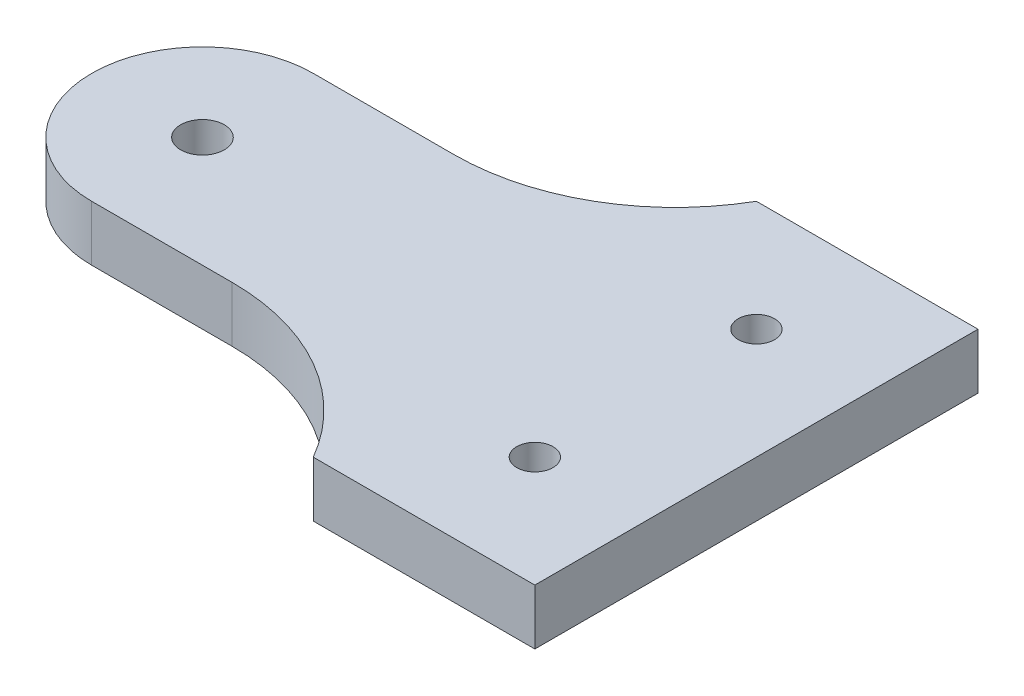
ISO-10303-21;
HEADER;
FILE_DESCRIPTION(('STEP AP214'),'2;1');
FILE_NAME('part.step','',(''),(''),'','','');
FILE_SCHEMA(('AUTOMOTIVE_DESIGN { 1 0 10303 214 1 1 1 1 }'));
ENDSEC;
DATA;
#1=APPLICATION_CONTEXT('core data for automotive mechanical design processes');
#2=APPLICATION_PROTOCOL_DEFINITION('international standard','automotive_design',2000,#1);
#3=PRODUCT_CONTEXT('',#1,'mechanical');
#4=PRODUCT('Part','Part','',(#3));
#5=PRODUCT_RELATED_PRODUCT_CATEGORY('part','',(#4));
#6=PRODUCT_DEFINITION_FORMATION('','',#4);
#7=PRODUCT_DEFINITION_CONTEXT('part definition',#1,'design');
#8=PRODUCT_DEFINITION('design','',#6,#7);
#9=PRODUCT_DEFINITION_SHAPE('','',#8);
#10=(LENGTH_UNIT() NAMED_UNIT(*) SI_UNIT(.MILLI.,.METRE.));
#11=(NAMED_UNIT(*) PLANE_ANGLE_UNIT() SI_UNIT($,.RADIAN.));
#12=(NAMED_UNIT(*) SI_UNIT($,.STERADIAN.) SOLID_ANGLE_UNIT());
#13=UNCERTAINTY_MEASURE_WITH_UNIT(LENGTH_MEASURE(1.E-05),#10,'distance_accuracy_value','');
#14=(GEOMETRIC_REPRESENTATION_CONTEXT(3) GLOBAL_UNCERTAINTY_ASSIGNED_CONTEXT((#13)) GLOBAL_UNIT_ASSIGNED_CONTEXT((#10,
#11,#12)) REPRESENTATION_CONTEXT('',''));
#15=CARTESIAN_POINT('',(0.,0.,0.));
#16=DIRECTION('',(0.,0.,1.));
#17=DIRECTION('',(1.,0.,0.));
#18=AXIS2_PLACEMENT_3D('',#15,#16,#17);
#19=CARTESIAN_POINT('',(0.,6.35,0.));
#20=DIRECTION('',(0.,-1.,0.));
#21=DIRECTION('',(0.,0.,-1.));
#22=AXIS2_PLACEMENT_3D('',#19,#20,#21);
#23=CYLINDRICAL_SURFACE('',#22,12.7);
#24=CARTESIAN_POINT('',(0.,0.,0.));
#25=DIRECTION('',(0.,1.,0.));
#26=DIRECTION('',(0.,0.,1.));
#27=AXIS2_PLACEMENT_3D('',#24,#25,#26);
#28=CIRCLE('',#27,12.7);
#29=CARTESIAN_POINT('',(0.,0.,-12.7));
#30=VERTEX_POINT('',#29);
#31=CARTESIAN_POINT('',(0.,0.,12.7));
#32=VERTEX_POINT('',#31);
#33=EDGE_CURVE('E122',#30,#32,#28,.T.);
#34=ORIENTED_EDGE('',*,*,#33,.T.);
#35=DIRECTION('',(0.,-1.,0.));
#36=VECTOR('',#35,1.);
#37=CARTESIAN_POINT('',(0.,6.35,12.7));
#38=LINE('',#37,#36);
#39=CARTESIAN_POINT('',(0.,6.35,12.7));
#40=VERTEX_POINT('',#39);
#41=EDGE_CURVE('E105',#40,#32,#38,.T.);
#42=ORIENTED_EDGE('',*,*,#41,.F.);
#43=CARTESIAN_POINT('',(0.,6.35,0.));
#44=DIRECTION('',(0.,1.,0.));
#45=DIRECTION('',(0.,0.,1.));
#46=AXIS2_PLACEMENT_3D('',#43,#44,#45);
#47=CIRCLE('',#46,12.7);
#48=CARTESIAN_POINT('',(0.,6.35,-12.7));
#49=VERTEX_POINT('',#48);
#50=EDGE_CURVE('E111',#49,#40,#47,.T.);
#51=ORIENTED_EDGE('',*,*,#50,.F.);
#52=DIRECTION('',(0.,-1.,0.));
#53=VECTOR('',#52,1.);
#54=CARTESIAN_POINT('',(0.,6.35,-12.7));
#55=LINE('',#54,#53);
#56=EDGE_CURVE('E153',#49,#30,#55,.T.);
#57=ORIENTED_EDGE('',*,*,#56,.T.);
#58=EDGE_LOOP('',(#34,#42,#51,#57));
#59=FACE_BOUND('',#58,.T.);
#60=ADVANCED_FACE('F37',(#59),#23,.T.);
#61=CARTESIAN_POINT('',(0.,6.35,12.7));
#62=DIRECTION('',(0.,0.,-1.));
#63=DIRECTION('',(-1.,0.,0.));
#64=AXIS2_PLACEMENT_3D('',#61,#62,#63);
#65=PLANE('',#64);
#66=DIRECTION('',(1.,0.,0.));
#67=VECTOR('',#66,1.);
#68=CARTESIAN_POINT('',(0.,0.,12.7));
#69=LINE('',#68,#67);
#70=CARTESIAN_POINT('',(16.1029547438753,0.,12.7));
#71=VERTEX_POINT('',#70);
#72=EDGE_CURVE('E169',#32,#71,#69,.T.);
#73=ORIENTED_EDGE('',*,*,#72,.T.);
#74=DIRECTION('',(0.,1.,0.));
#75=VECTOR('',#74,1.);
#76=CARTESIAN_POINT('',(16.1029547438753,6.35,12.7));
#77=LINE('',#76,#75);
#78=CARTESIAN_POINT('',(16.1029547438753,6.35,12.7));
#79=VERTEX_POINT('',#78);
#80=EDGE_CURVE('E108',#71,#79,#77,.T.);
#81=ORIENTED_EDGE('',*,*,#80,.T.);
#82=DIRECTION('',(1.,0.,0.));
#83=VECTOR('',#82,1.);
#84=CARTESIAN_POINT('',(0.,6.35,12.7));
#85=LINE('',#84,#83);
#86=EDGE_CURVE('E100',#40,#79,#85,.T.);
#87=ORIENTED_EDGE('',*,*,#86,.F.);
#88=ORIENTED_EDGE('',*,*,#41,.T.);
#89=EDGE_LOOP('',(#73,#81,#87,#88));
#90=FACE_BOUND('',#89,.T.);
#91=ADVANCED_FACE('F103',(#90),#65,.F.);
#92=CARTESIAN_POINT('',(63.5,6.35,25.4));
#93=DIRECTION('',(0.,0.,-1.));
#94=DIRECTION('',(-1.,0.,0.));
#95=AXIS2_PLACEMENT_3D('',#92,#93,#94);
#96=PLANE('',#95);
#97=DIRECTION('',(1.,0.,0.));
#98=VECTOR('',#97,1.);
#99=CARTESIAN_POINT('',(63.5,0.,25.4));
#100=LINE('',#99,#98);
#101=CARTESIAN_POINT('',(38.1,0.,25.4));
#102=VERTEX_POINT('',#101);
#103=CARTESIAN_POINT('',(63.5,0.,25.4));
#104=VERTEX_POINT('',#103);
#105=EDGE_CURVE('E167',#102,#104,#100,.T.);
#106=ORIENTED_EDGE('',*,*,#105,.T.);
#107=DIRECTION('',(0.,-1.,0.));
#108=VECTOR('',#107,1.);
#109=CARTESIAN_POINT('',(63.5,6.35,25.4));
#110=LINE('',#109,#108);
#111=CARTESIAN_POINT('',(63.5,6.35,25.4));
#112=VERTEX_POINT('',#111);
#113=EDGE_CURVE('E128',#112,#104,#110,.T.);
#114=ORIENTED_EDGE('',*,*,#113,.F.);
#115=DIRECTION('',(1.,0.,0.));
#116=VECTOR('',#115,1.);
#117=CARTESIAN_POINT('',(63.5,6.35,25.4));
#118=LINE('',#117,#116);
#119=CARTESIAN_POINT('',(38.1,6.35,25.4));
#120=VERTEX_POINT('',#119);
#121=EDGE_CURVE('E110',#120,#112,#118,.T.);
#122=ORIENTED_EDGE('',*,*,#121,.F.);
#123=DIRECTION('',(0.,-1.,0.));
#124=VECTOR('',#123,1.);
#125=CARTESIAN_POINT('',(38.1,6.35,25.4));
#126=LINE('',#125,#124);
#127=EDGE_CURVE('E123',#120,#102,#126,.T.);
#128=ORIENTED_EDGE('',*,*,#127,.T.);
#129=EDGE_LOOP('',(#106,#114,#122,#128));
#130=FACE_BOUND('',#129,.T.);
#131=ADVANCED_FACE('F226',(#130),#96,.F.);
#132=CARTESIAN_POINT('',(63.5,6.35,-25.4));
#133=DIRECTION('',(-1.,0.,0.));
#134=DIRECTION('',(0.,0.,1.));
#135=AXIS2_PLACEMENT_3D('',#132,#133,#134);
#136=PLANE('',#135);
#137=DIRECTION('',(0.,0.,-1.));
#138=VECTOR('',#137,1.);
#139=CARTESIAN_POINT('',(63.5,0.,-25.4));
#140=LINE('',#139,#138);
#141=CARTESIAN_POINT('',(63.5,0.,-25.4));
#142=VERTEX_POINT('',#141);
#143=EDGE_CURVE('E151',#104,#142,#140,.T.);
#144=ORIENTED_EDGE('',*,*,#143,.T.);
#145=DIRECTION('',(0.,-1.,0.));
#146=VECTOR('',#145,1.);
#147=CARTESIAN_POINT('',(63.5,6.35,-25.4));
#148=LINE('',#147,#146);
#149=CARTESIAN_POINT('',(63.5,6.35,-25.4));
#150=VERTEX_POINT('',#149);
#151=EDGE_CURVE('E150',#150,#142,#148,.T.);
#152=ORIENTED_EDGE('',*,*,#151,.F.);
#153=DIRECTION('',(0.,0.,-1.));
#154=VECTOR('',#153,1.);
#155=CARTESIAN_POINT('',(63.5,6.35,-25.4));
#156=LINE('',#155,#154);
#157=EDGE_CURVE('E163',#112,#150,#156,.T.);
#158=ORIENTED_EDGE('',*,*,#157,.F.);
#159=ORIENTED_EDGE('',*,*,#113,.T.);
#160=EDGE_LOOP('',(#144,#152,#158,#159));
#161=FACE_BOUND('',#160,.T.);
#162=ADVANCED_FACE('F162',(#161),#136,.F.);
#163=CARTESIAN_POINT('',(38.1,6.35,-25.4));
#164=DIRECTION('',(0.,0.,1.));
#165=DIRECTION('',(1.,0.,0.));
#166=AXIS2_PLACEMENT_3D('',#163,#164,#165);
#167=PLANE('',#166);
#168=DIRECTION('',(-1.,0.,0.));
#169=VECTOR('',#168,1.);
#170=CARTESIAN_POINT('',(38.1,0.,-25.4));
#171=LINE('',#170,#169);
#172=CARTESIAN_POINT('',(38.1,0.,-25.4));
#173=VERTEX_POINT('',#172);
#174=EDGE_CURVE('E142',#142,#173,#171,.T.);
#175=ORIENTED_EDGE('',*,*,#174,.T.);
#176=DIRECTION('',(0.,-1.,0.));
#177=VECTOR('',#176,1.);
#178=CARTESIAN_POINT('',(38.1,6.35,-25.4));
#179=LINE('',#178,#177);
#180=CARTESIAN_POINT('',(38.1,6.35,-25.4));
#181=VERTEX_POINT('',#180);
#182=EDGE_CURVE('E148',#181,#173,#179,.T.);
#183=ORIENTED_EDGE('',*,*,#182,.F.);
#184=DIRECTION('',(-1.,0.,0.));
#185=VECTOR('',#184,1.);
#186=CARTESIAN_POINT('',(38.1,6.35,-25.4));
#187=LINE('',#186,#185);
#188=EDGE_CURVE('E181',#150,#181,#187,.T.);
#189=ORIENTED_EDGE('',*,*,#188,.F.);
#190=ORIENTED_EDGE('',*,*,#151,.T.);
#191=EDGE_LOOP('',(#175,#183,#189,#190));
#192=FACE_BOUND('',#191,.T.);
#193=ADVANCED_FACE('F146',(#192),#167,.F.);
#194=CARTESIAN_POINT('',(0.,6.35,-12.7));
#195=DIRECTION('',(0.,0.,1.));
#196=DIRECTION('',(1.,0.,0.));
#197=AXIS2_PLACEMENT_3D('',#194,#195,#196);
#198=PLANE('',#197);
#199=DIRECTION('',(-1.,0.,0.));
#200=VECTOR('',#199,1.);
#201=CARTESIAN_POINT('',(0.,6.35,-12.7));
#202=LINE('',#201,#200);
#203=CARTESIAN_POINT('',(16.1029547438753,6.35,-12.7));
#204=VERTEX_POINT('',#203);
#205=EDGE_CURVE('E115',#204,#49,#202,.T.);
#206=ORIENTED_EDGE('',*,*,#205,.F.);
#207=DIRECTION('',(0.,-1.,0.));
#208=VECTOR('',#207,1.);
#209=CARTESIAN_POINT('',(16.1029547438753,6.35,-12.7));
#210=LINE('',#209,#208);
#211=CARTESIAN_POINT('',(16.1029547438753,0.,-12.7));
#212=VERTEX_POINT('',#211);
#213=EDGE_CURVE('E125',#204,#212,#210,.T.);
#214=ORIENTED_EDGE('',*,*,#213,.T.);
#215=DIRECTION('',(-1.,0.,0.));
#216=VECTOR('',#215,1.);
#217=CARTESIAN_POINT('',(0.,0.,-12.7));
#218=LINE('',#217,#216);
#219=EDGE_CURVE('E119',#212,#30,#218,.T.);
#220=ORIENTED_EDGE('',*,*,#219,.T.);
#221=ORIENTED_EDGE('',*,*,#56,.F.);
#222=EDGE_LOOP('',(#206,#214,#220,#221));
#223=FACE_BOUND('',#222,.T.);
#224=ADVANCED_FACE('F173',(#223),#198,.F.);
#225=CARTESIAN_POINT('',(0.,6.35,0.));
#226=DIRECTION('',(0.,1.,0.));
#227=DIRECTION('',(0.,0.,1.));
#228=AXIS2_PLACEMENT_3D('',#225,#226,#227);
#229=PLANE('',#228);
#230=CARTESIAN_POINT('',(50.8,6.35,-12.7));
#231=DIRECTION('',(0.,1.,0.));
#232=DIRECTION('',(0.,0.,1.));
#233=AXIS2_PLACEMENT_3D('',#230,#231,#232);
#234=CIRCLE('',#233,2.0828);
#235=CARTESIAN_POINT('',(50.8,6.35,-10.6172));
#236=VERTEX_POINT('',#235);
#237=EDGE_CURVE('E191',#236,#236,#234,.T.);
#238=ORIENTED_EDGE('',*,*,#237,.F.);
#239=EDGE_LOOP('',(#238));
#240=FACE_BOUND('',#239,.T.);
#241=CARTESIAN_POINT('',(50.8,6.35,12.7));
#242=DIRECTION('',(0.,1.,0.));
#243=DIRECTION('',(0.,0.,1.));
#244=AXIS2_PLACEMENT_3D('',#241,#242,#243);
#245=CIRCLE('',#244,2.0828);
#246=CARTESIAN_POINT('',(50.8,6.35,14.7828));
#247=VERTEX_POINT('',#246);
#248=EDGE_CURVE('E192',#247,#247,#245,.T.);
#249=ORIENTED_EDGE('',*,*,#248,.F.);
#250=EDGE_LOOP('',(#249));
#251=FACE_BOUND('',#250,.T.);
#252=CARTESIAN_POINT('',(0.,6.35,0.));
#253=DIRECTION('',(0.,1.,0.));
#254=DIRECTION('',(0.,0.,1.));
#255=AXIS2_PLACEMENT_3D('',#252,#253,#254);
#256=CIRCLE('',#255,2.5);
#257=CARTESIAN_POINT('',(0.,6.35,2.5));
#258=VERTEX_POINT('',#257);
#259=EDGE_CURVE('E177',#258,#258,#256,.T.);
#260=ORIENTED_EDGE('',*,*,#259,.F.);
#261=EDGE_LOOP('',(#260));
#262=FACE_BOUND('',#261,.T.);
#263=ORIENTED_EDGE('',*,*,#50,.T.);
#264=ORIENTED_EDGE('',*,*,#86,.T.);
#265=CARTESIAN_POINT('',(16.1029547438753,6.35,38.1));
#266=DIRECTION('',(0.,1.,0.));
#267=DIRECTION('',(0.,0.,1.));
#268=AXIS2_PLACEMENT_3D('',#265,#266,#267);
#269=CIRCLE('',#268,25.4);
#270=EDGE_CURVE('E135',#79,#120,#269,.F.);
#271=ORIENTED_EDGE('',*,*,#270,.T.);
#272=ORIENTED_EDGE('',*,*,#121,.T.);
#273=ORIENTED_EDGE('',*,*,#157,.T.);
#274=ORIENTED_EDGE('',*,*,#188,.T.);
#275=CARTESIAN_POINT('',(16.1029547438753,6.35,-38.1));
#276=DIRECTION('',(0.,1.,0.));
#277=DIRECTION('',(0.,0.,1.));
#278=AXIS2_PLACEMENT_3D('',#275,#276,#277);
#279=CIRCLE('',#278,25.4);
#280=EDGE_CURVE('E11',#181,#204,#279,.F.);
#281=ORIENTED_EDGE('',*,*,#280,.T.);
#282=ORIENTED_EDGE('',*,*,#205,.T.);
#283=EDGE_LOOP('',(#263,#264,#271,#272,#273,#274,#281,#282));
#284=FACE_BOUND('',#283,.T.);
#285=ADVANCED_FACE('F114',(#240,#251,#262,#284),#229,.T.);
#286=CARTESIAN_POINT('',(0.,0.,0.));
#287=DIRECTION('',(0.,1.,0.));
#288=DIRECTION('',(0.,0.,1.));
#289=AXIS2_PLACEMENT_3D('',#286,#287,#288);
#290=PLANE('',#289);
#291=CARTESIAN_POINT('',(50.8,0.,-12.7));
#292=DIRECTION('',(0.,1.,0.));
#293=DIRECTION('',(0.,0.,1.));
#294=AXIS2_PLACEMENT_3D('',#291,#292,#293);
#295=CIRCLE('',#294,2.0828);
#296=CARTESIAN_POINT('',(50.8,0.,-10.6172));
#297=VERTEX_POINT('',#296);
#298=EDGE_CURVE('E187',#297,#297,#295,.F.);
#299=ORIENTED_EDGE('',*,*,#298,.F.);
#300=EDGE_LOOP('',(#299));
#301=FACE_BOUND('',#300,.T.);
#302=CARTESIAN_POINT('',(50.8,0.,12.7));
#303=DIRECTION('',(0.,1.,0.));
#304=DIRECTION('',(0.,0.,1.));
#305=AXIS2_PLACEMENT_3D('',#302,#303,#304);
#306=CIRCLE('',#305,2.0828);
#307=CARTESIAN_POINT('',(50.8,0.,14.7828));
#308=VERTEX_POINT('',#307);
#309=EDGE_CURVE('E188',#308,#308,#306,.F.);
#310=ORIENTED_EDGE('',*,*,#309,.F.);
#311=EDGE_LOOP('',(#310));
#312=FACE_BOUND('',#311,.T.);
#313=CARTESIAN_POINT('',(0.,0.,0.));
#314=DIRECTION('',(0.,1.,0.));
#315=DIRECTION('',(0.,0.,1.));
#316=AXIS2_PLACEMENT_3D('',#313,#314,#315);
#317=CIRCLE('',#316,2.5);
#318=CARTESIAN_POINT('',(0.,0.,2.5));
#319=VERTEX_POINT('',#318);
#320=EDGE_CURVE('E174',#319,#319,#317,.F.);
#321=ORIENTED_EDGE('',*,*,#320,.F.);
#322=EDGE_LOOP('',(#321));
#323=FACE_BOUND('',#322,.T.);
#324=ORIENTED_EDGE('',*,*,#33,.F.);
#325=ORIENTED_EDGE('',*,*,#219,.F.);
#326=CARTESIAN_POINT('',(16.1029547438753,0.,-38.1));
#327=DIRECTION('',(0.,1.,0.));
#328=DIRECTION('',(0.,0.,1.));
#329=AXIS2_PLACEMENT_3D('',#326,#327,#328);
#330=CIRCLE('',#329,25.4);
#331=EDGE_CURVE('E45',#212,#173,#330,.T.);
#332=ORIENTED_EDGE('',*,*,#331,.T.);
#333=ORIENTED_EDGE('',*,*,#174,.F.);
#334=ORIENTED_EDGE('',*,*,#143,.F.);
#335=ORIENTED_EDGE('',*,*,#105,.F.);
#336=CARTESIAN_POINT('',(16.1029547438753,0.,38.1));
#337=DIRECTION('',(0.,1.,0.));
#338=DIRECTION('',(0.,0.,1.));
#339=AXIS2_PLACEMENT_3D('',#336,#337,#338);
#340=CIRCLE('',#339,25.4);
#341=EDGE_CURVE('E133',#102,#71,#340,.T.);
#342=ORIENTED_EDGE('',*,*,#341,.T.);
#343=ORIENTED_EDGE('',*,*,#72,.F.);
#344=EDGE_LOOP('',(#324,#325,#332,#333,#334,#335,#342,#343));
#345=FACE_BOUND('',#344,.T.);
#346=ADVANCED_FACE('F140',(#301,#312,#323,#345),#290,.F.);
#347=CARTESIAN_POINT('',(16.1029547438753,6.35,38.1));
#348=DIRECTION('',(0.,1.,0.));
#349=DIRECTION('',(0.,0.,1.));
#350=AXIS2_PLACEMENT_3D('',#347,#348,#349);
#351=CYLINDRICAL_SURFACE('',#350,25.4);
#352=ORIENTED_EDGE('',*,*,#270,.F.);
#353=ORIENTED_EDGE('',*,*,#80,.F.);
#354=ORIENTED_EDGE('',*,*,#341,.F.);
#355=ORIENTED_EDGE('',*,*,#127,.F.);
#356=EDGE_LOOP('',(#352,#353,#354,#355));
#357=FACE_BOUND('',#356,.T.);
#358=ADVANCED_FACE('F220',(#357),#351,.F.);
#359=CARTESIAN_POINT('',(16.1029547438753,6.35,-38.1));
#360=DIRECTION('',(0.,-1.,0.));
#361=DIRECTION('',(0.,0.,-1.));
#362=AXIS2_PLACEMENT_3D('',#359,#360,#361);
#363=CYLINDRICAL_SURFACE('',#362,25.4);
#364=ORIENTED_EDGE('',*,*,#280,.F.);
#365=ORIENTED_EDGE('',*,*,#182,.T.);
#366=ORIENTED_EDGE('',*,*,#331,.F.);
#367=ORIENTED_EDGE('',*,*,#213,.F.);
#368=EDGE_LOOP('',(#364,#365,#366,#367));
#369=FACE_BOUND('',#368,.T.);
#370=ADVANCED_FACE('F39',(#369),#363,.F.);
#371=CARTESIAN_POINT('',(0.,-7.07106781186547,0.));
#372=DIRECTION('',(0.,1.,0.));
#373=DIRECTION('',(0.,0.,1.));
#374=AXIS2_PLACEMENT_3D('',#371,#372,#373);
#375=CYLINDRICAL_SURFACE('',#374,2.5);
#376=CARTESIAN_POINT('',(0.,0.,2.5));
#377=CARTESIAN_POINT('',(0.,0.0661458333333324,2.5));
#378=CARTESIAN_POINT('',(0.,0.132291666666666,2.5));
#379=CARTESIAN_POINT('',(0.,0.264583333333332,2.5));
#380=CARTESIAN_POINT('',(0.,0.330729166666666,2.5));
#381=CARTESIAN_POINT('',(0.,0.463020833333332,2.5));
#382=CARTESIAN_POINT('',(0.,0.529166666666666,2.5));
#383=CARTESIAN_POINT('',(0.,0.661458333333332,2.5));
#384=CARTESIAN_POINT('',(0.,0.727604166666665,2.5));
#385=CARTESIAN_POINT('',(0.,0.859895833333331,2.5));
#386=CARTESIAN_POINT('',(0.,0.926041666666665,2.5));
#387=CARTESIAN_POINT('',(0.,1.05833333333333,2.5));
#388=CARTESIAN_POINT('',(0.,1.12447916666667,2.5));
#389=CARTESIAN_POINT('',(0.,1.25677083333333,2.5));
#390=CARTESIAN_POINT('',(0.,1.32291666666666,2.5));
#391=CARTESIAN_POINT('',(0.,1.45520833333333,2.5));
#392=CARTESIAN_POINT('',(0.,1.52135416666667,2.5));
#393=CARTESIAN_POINT('',(0.,1.65364583333333,2.5));
#394=CARTESIAN_POINT('',(0.,1.71979166666667,2.5));
#395=CARTESIAN_POINT('',(0.,1.85208333333333,2.5));
#396=CARTESIAN_POINT('',(0.,1.91822916666667,2.5));
#397=CARTESIAN_POINT('',(0.,2.05052083333333,2.5));
#398=CARTESIAN_POINT('',(0.,2.11666666666667,2.5));
#399=CARTESIAN_POINT('',(0.,2.24895833333333,2.5));
#400=CARTESIAN_POINT('',(0.,2.31510416666667,2.5));
#401=CARTESIAN_POINT('',(0.,2.44739583333333,2.5));
#402=CARTESIAN_POINT('',(0.,2.51354166666667,2.5));
#403=CARTESIAN_POINT('',(0.,2.64583333333333,2.5));
#404=CARTESIAN_POINT('',(0.,2.71197916666667,2.5));
#405=CARTESIAN_POINT('',(0.,2.84427083333333,2.5));
#406=CARTESIAN_POINT('',(0.,2.91041666666667,2.5));
#407=CARTESIAN_POINT('',(0.,3.04270833333333,2.5));
#408=CARTESIAN_POINT('',(0.,3.10885416666667,2.5));
#409=CARTESIAN_POINT('',(0.,3.24114583333333,2.5));
#410=CARTESIAN_POINT('',(0.,3.30729166666667,2.5));
#411=CARTESIAN_POINT('',(0.,3.43958333333333,2.5));
#412=CARTESIAN_POINT('',(0.,3.50572916666667,2.5));
#413=CARTESIAN_POINT('',(0.,3.63802083333333,2.5));
#414=CARTESIAN_POINT('',(0.,3.70416666666667,2.5));
#415=CARTESIAN_POINT('',(0.,3.83645833333333,2.5));
#416=CARTESIAN_POINT('',(0.,3.90260416666667,2.5));
#417=CARTESIAN_POINT('',(0.,4.03489583333333,2.5));
#418=CARTESIAN_POINT('',(0.,4.10104166666667,2.5));
#419=CARTESIAN_POINT('',(0.,4.23333333333333,2.5));
#420=CARTESIAN_POINT('',(0.,4.29947916666667,2.5));
#421=CARTESIAN_POINT('',(0.,4.43177083333333,2.5));
#422=CARTESIAN_POINT('',(0.,4.49791666666667,2.5));
#423=CARTESIAN_POINT('',(0.,4.63020833333333,2.5));
#424=CARTESIAN_POINT('',(0.,4.69635416666667,2.5));
#425=CARTESIAN_POINT('',(0.,4.82864583333333,2.5));
#426=CARTESIAN_POINT('',(0.,4.89479166666667,2.5));
#427=CARTESIAN_POINT('',(0.,5.02708333333333,2.5));
#428=CARTESIAN_POINT('',(0.,5.09322916666667,2.5));
#429=CARTESIAN_POINT('',(0.,5.22552083333333,2.5));
#430=CARTESIAN_POINT('',(0.,5.29166666666667,2.5));
#431=CARTESIAN_POINT('',(0.,5.42395833333333,2.5));
#432=CARTESIAN_POINT('',(0.,5.49010416666667,2.5));
#433=CARTESIAN_POINT('',(0.,5.62239583333333,2.5));
#434=CARTESIAN_POINT('',(0.,5.68854166666667,2.5));
#435=CARTESIAN_POINT('',(0.,5.82083333333333,2.5));
#436=CARTESIAN_POINT('',(0.,5.88697916666667,2.5));
#437=CARTESIAN_POINT('',(0.,6.01927083333333,2.5));
#438=CARTESIAN_POINT('',(0.,6.08541666666667,2.5));
#439=CARTESIAN_POINT('',(0.,6.21770833333333,2.5));
#440=CARTESIAN_POINT('',(0.,6.28385416666667,2.5));
#441=CARTESIAN_POINT('',(0.,6.35,2.5));
#442=B_SPLINE_CURVE_WITH_KNOTS('',3,(#376,#377,#378,#379,#380,#381,#382,#383,#384,#385,#386,
#387,#388,#389,#390,#391,#392,#393,#394,#395,#396,#397,#398,#399,#400,#401,#402,#403,#404,#405,
#406,#407,#408,#409,#410,#411,#412,#413,#414,#415,#416,#417,#418,#419,#420,#421,#422,#423,#424,
#425,#426,#427,#428,#429,#430,#431,#432,#433,#434,#435,#436,#437,#438,#439,#440,#441),
.UNSPECIFIED.,.F.,.F.,(4,2,2,2,2,2,2,2,2,2,2,2,2,2,2,2,2,2,2,2,2,2,2,2,2,2,2,2,2,2,2,2,4),(0.,
0.1984375,0.396875,0.5953125,0.793749999999998,0.992187499999999,1.190625,1.3890625,1.5875,
1.7859375,1.984375,2.1828125,2.38125,2.5796875,2.778125,2.9765625,3.175,3.3734375,3.571875,
3.7703125,3.96875,4.1671875,4.365625,4.5640625,4.7625,4.9609375,5.159375,5.3578125,5.55625,
5.7546875,5.953125,6.1515625,6.35),.UNSPECIFIED.);
#443=EDGE_CURVE('BSEAM209',#319,#258,#442,.T.);
#444=ORIENTED_EDGE('',*,*,#320,.T.);
#445=ORIENTED_EDGE('',*,*,#259,.T.);
#446=ORIENTED_EDGE('',*,*,#443,.T.);
#447=ORIENTED_EDGE('',*,*,#443,.F.);
#448=EDGE_LOOP('',(#444,#446,#445,#447));
#449=FACE_BOUND('',#448,.T.);
#450=ADVANCED_FACE('F209',(#449),#375,.F.);
#451=CARTESIAN_POINT('',(50.8,-5.89104801542136,12.7));
#452=DIRECTION('',(0.,1.,0.));
#453=DIRECTION('',(0.,0.,1.));
#454=AXIS2_PLACEMENT_3D('',#451,#452,#453);
#455=CYLINDRICAL_SURFACE('',#454,2.0828);
#456=ORIENTED_EDGE('',*,*,#309,.T.);
#457=EDGE_LOOP('',(#456));
#458=FACE_BOUND('',#457,.T.);
#459=ORIENTED_EDGE('',*,*,#248,.T.);
#460=EDGE_LOOP('',(#459));
#461=FACE_BOUND('',#460,.T.);
#462=ADVANCED_FACE('F211',(#458,#461),#455,.F.);
#463=CARTESIAN_POINT('',(50.8,-5.89104801542136,-12.7));
#464=DIRECTION('',(0.,1.,0.));
#465=DIRECTION('',(0.,0.,1.));
#466=AXIS2_PLACEMENT_3D('',#463,#464,#465);
#467=CYLINDRICAL_SURFACE('',#466,2.0828);
#468=ORIENTED_EDGE('',*,*,#298,.T.);
#469=EDGE_LOOP('',(#468));
#470=FACE_BOUND('',#469,.T.);
#471=ORIENTED_EDGE('',*,*,#237,.T.);
#472=EDGE_LOOP('',(#471));
#473=FACE_BOUND('',#472,.T.);
#474=ADVANCED_FACE('F200',(#470,#473),#467,.F.);
#475=CLOSED_SHELL('',(#60,#91,#131,#162,#193,#224,#285,#346,#358,#370,#450,#462,#474));
#476=MANIFOLD_SOLID_BREP('B2',#475);
#477=ADVANCED_BREP_SHAPE_REPRESENTATION('',(#18,#476),#14);
#478=SHAPE_DEFINITION_REPRESENTATION(#9,#477);
ENDSEC;
END-ISO-10303-21;
